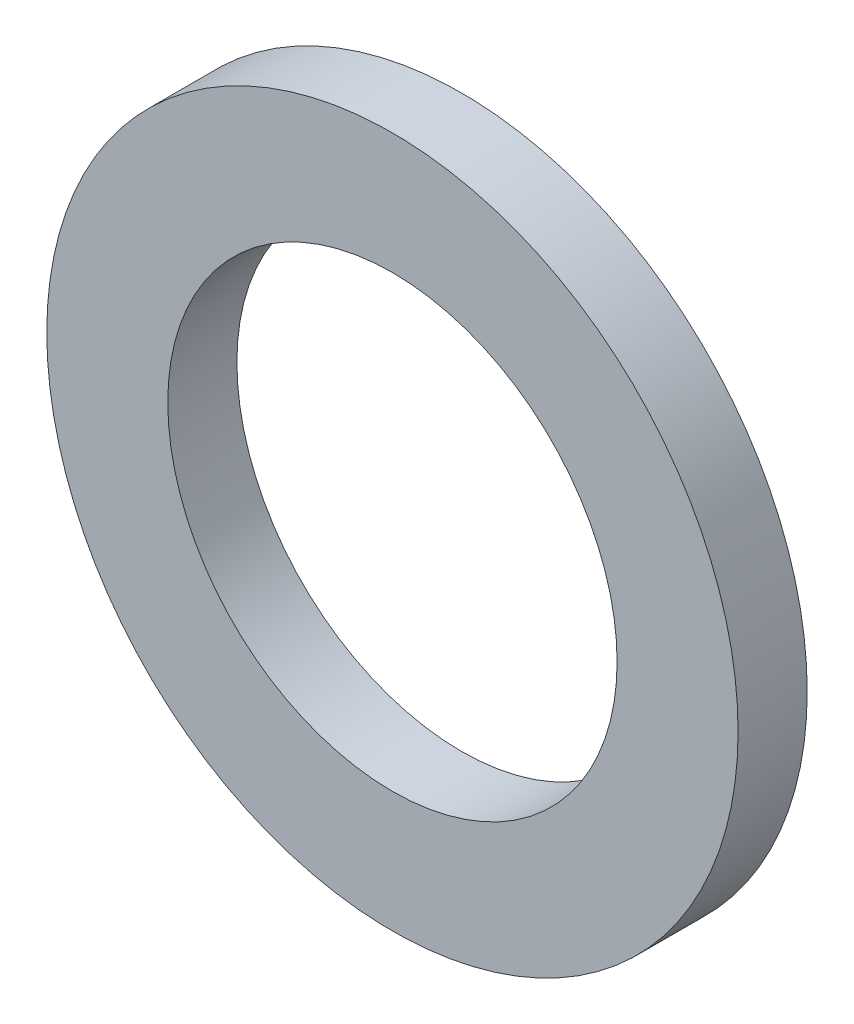
ISO-10303-21;
HEADER;
FILE_DESCRIPTION(('STEP AP214'),'2;1');
FILE_NAME('part.step','',(''),(''),'','','');
FILE_SCHEMA(('AUTOMOTIVE_DESIGN { 1 0 10303 214 1 1 1 1 }'));
ENDSEC;
DATA;
#1=APPLICATION_CONTEXT('core data for automotive mechanical design processes');
#2=APPLICATION_PROTOCOL_DEFINITION('international standard','automotive_design',2000,#1);
#3=PRODUCT_CONTEXT('',#1,'mechanical');
#4=PRODUCT('Part','Part','',(#3));
#5=PRODUCT_RELATED_PRODUCT_CATEGORY('part','',(#4));
#6=PRODUCT_DEFINITION_FORMATION('','',#4);
#7=PRODUCT_DEFINITION_CONTEXT('part definition',#1,'design');
#8=PRODUCT_DEFINITION('design','',#6,#7);
#9=PRODUCT_DEFINITION_SHAPE('','',#8);
#10=(LENGTH_UNIT() NAMED_UNIT(*) SI_UNIT(.MILLI.,.METRE.));
#11=(NAMED_UNIT(*) PLANE_ANGLE_UNIT() SI_UNIT($,.RADIAN.));
#12=(NAMED_UNIT(*) SI_UNIT($,.STERADIAN.) SOLID_ANGLE_UNIT());
#13=UNCERTAINTY_MEASURE_WITH_UNIT(LENGTH_MEASURE(1.E-05),#10,'distance_accuracy_value','');
#14=(GEOMETRIC_REPRESENTATION_CONTEXT(3) GLOBAL_UNCERTAINTY_ASSIGNED_CONTEXT((#13)) GLOBAL_UNIT_ASSIGNED_CONTEXT((#10,
#11,#12)) REPRESENTATION_CONTEXT('',''));
#15=CARTESIAN_POINT('',(0.,0.,0.));
#16=DIRECTION('',(0.,0.,1.));
#17=DIRECTION('',(1.,0.,0.));
#18=AXIS2_PLACEMENT_3D('',#15,#16,#17);
#19=CARTESIAN_POINT('',(0.,0.,1.));
#20=DIRECTION('',(0.,0.,1.));
#21=DIRECTION('',(1.,0.,0.));
#22=AXIS2_PLACEMENT_3D('',#19,#20,#21);
#23=PLANE('',#22);
#24=CARTESIAN_POINT('',(0.,0.,1.));
#25=DIRECTION('',(0.,0.,1.));
#26=DIRECTION('',(1.,0.,0.));
#27=AXIS2_PLACEMENT_3D('',#24,#25,#26);
#28=CIRCLE('',#27,5.);
#29=CARTESIAN_POINT('',(5.,0.,1.));
#30=VERTEX_POINT('',#29);
#31=EDGE_CURVE('E10',#30,#30,#28,.T.);
#32=ORIENTED_EDGE('',*,*,#31,.T.);
#33=EDGE_LOOP('',(#32));
#34=FACE_BOUND('',#33,.T.);
#35=CARTESIAN_POINT('',(0.,0.,1.));
#36=DIRECTION('',(0.,0.,1.));
#37=DIRECTION('',(1.,0.,0.));
#38=AXIS2_PLACEMENT_3D('',#35,#36,#37);
#39=CIRCLE('',#38,3.25);
#40=CARTESIAN_POINT('',(3.25,0.,1.));
#41=VERTEX_POINT('',#40);
#42=EDGE_CURVE('E42',#41,#41,#39,.T.);
#43=ORIENTED_EDGE('',*,*,#42,.F.);
#44=EDGE_LOOP('',(#43));
#45=FACE_BOUND('',#44,.T.);
#46=ADVANCED_FACE('F31',(#34,#45),#23,.T.);
#47=CARTESIAN_POINT('',(0.,0.,0.));
#48=DIRECTION('',(0.,0.,1.));
#49=DIRECTION('',(1.,0.,0.));
#50=AXIS2_PLACEMENT_3D('',#47,#48,#49);
#51=PLANE('',#50);
#52=CARTESIAN_POINT('',(0.,0.,0.));
#53=DIRECTION('',(0.,0.,1.));
#54=DIRECTION('',(1.,0.,0.));
#55=AXIS2_PLACEMENT_3D('',#52,#53,#54);
#56=CIRCLE('',#55,5.);
#57=CARTESIAN_POINT('',(5.,0.,0.));
#58=VERTEX_POINT('',#57);
#59=EDGE_CURVE('E35',#58,#58,#56,.T.);
#60=ORIENTED_EDGE('',*,*,#59,.F.);
#61=EDGE_LOOP('',(#60));
#62=FACE_BOUND('',#61,.T.);
#63=CARTESIAN_POINT('',(0.,0.,0.));
#64=DIRECTION('',(0.,0.,1.));
#65=DIRECTION('',(1.,0.,0.));
#66=AXIS2_PLACEMENT_3D('',#63,#64,#65);
#67=CIRCLE('',#66,3.25);
#68=CARTESIAN_POINT('',(3.25,0.,0.));
#69=VERTEX_POINT('',#68);
#70=EDGE_CURVE('E44',#69,#69,#67,.T.);
#71=ORIENTED_EDGE('',*,*,#70,.T.);
#72=EDGE_LOOP('',(#71));
#73=FACE_BOUND('',#72,.T.);
#74=ADVANCED_FACE('F54',(#62,#73),#51,.F.);
#75=CARTESIAN_POINT('',(0.,0.,1.));
#76=DIRECTION('',(0.,0.,-1.));
#77=DIRECTION('',(-1.,0.,0.));
#78=AXIS2_PLACEMENT_3D('',#75,#76,#77);
#79=CYLINDRICAL_SURFACE('',#78,5.);
#80=ORIENTED_EDGE('',*,*,#31,.F.);
#81=EDGE_LOOP('',(#80));
#82=FACE_BOUND('',#81,.T.);
#83=ORIENTED_EDGE('',*,*,#59,.T.);
#84=EDGE_LOOP('',(#83));
#85=FACE_BOUND('',#84,.T.);
#86=ADVANCED_FACE('F33',(#82,#85),#79,.T.);
#87=CARTESIAN_POINT('',(0.,0.,1.));
#88=DIRECTION('',(0.,0.,-1.));
#89=DIRECTION('',(-1.,0.,0.));
#90=AXIS2_PLACEMENT_3D('',#87,#88,#89);
#91=CYLINDRICAL_SURFACE('',#90,3.25);
#92=ORIENTED_EDGE('',*,*,#42,.T.);
#93=EDGE_LOOP('',(#92));
#94=FACE_BOUND('',#93,.T.);
#95=ORIENTED_EDGE('',*,*,#70,.F.);
#96=EDGE_LOOP('',(#95));
#97=FACE_BOUND('',#96,.T.);
#98=ADVANCED_FACE('F50',(#94,#97),#91,.F.);
#99=CLOSED_SHELL('',(#46,#74,#86,#98));
#100=MANIFOLD_SOLID_BREP('B2',#99);
#101=ADVANCED_BREP_SHAPE_REPRESENTATION('',(#18,#100),#14);
#102=SHAPE_DEFINITION_REPRESENTATION(#9,#101);
ENDSEC;
END-ISO-10303-21;
